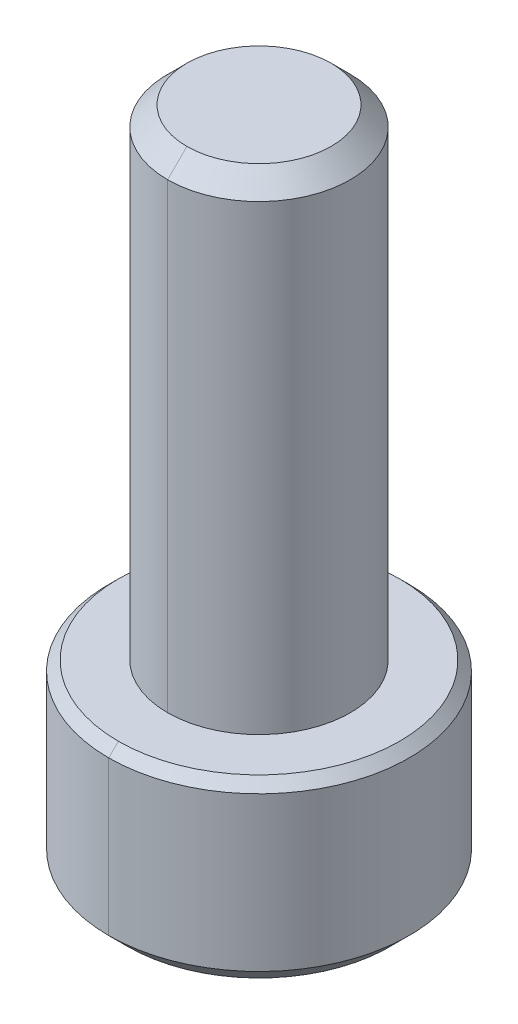
ISO-10303-21;
HEADER;
FILE_DESCRIPTION(('STEP AP214'),'2;1');
FILE_NAME('part.step','',(''),(''),'','','');
FILE_SCHEMA(('AUTOMOTIVE_DESIGN { 1 0 10303 214 1 1 1 1 }'));
ENDSEC;
DATA;
#1=APPLICATION_CONTEXT('core data for automotive mechanical design processes');
#2=APPLICATION_PROTOCOL_DEFINITION('international standard','automotive_design',2000,#1);
#3=PRODUCT_CONTEXT('',#1,'mechanical');
#4=PRODUCT('Part','Part','',(#3));
#5=PRODUCT_RELATED_PRODUCT_CATEGORY('part','',(#4));
#6=PRODUCT_DEFINITION_FORMATION('','',#4);
#7=PRODUCT_DEFINITION_CONTEXT('part definition',#1,'design');
#8=PRODUCT_DEFINITION('design','',#6,#7);
#9=PRODUCT_DEFINITION_SHAPE('','',#8);
#10=(LENGTH_UNIT() NAMED_UNIT(*) SI_UNIT(.MILLI.,.METRE.));
#11=(NAMED_UNIT(*) PLANE_ANGLE_UNIT() SI_UNIT($,.RADIAN.));
#12=(NAMED_UNIT(*) SI_UNIT($,.STERADIAN.) SOLID_ANGLE_UNIT());
#13=UNCERTAINTY_MEASURE_WITH_UNIT(LENGTH_MEASURE(1.E-05),#10,'distance_accuracy_value','');
#14=(GEOMETRIC_REPRESENTATION_CONTEXT(3) GLOBAL_UNCERTAINTY_ASSIGNED_CONTEXT((#13)) GLOBAL_UNIT_ASSIGNED_CONTEXT((#10,
#11,#12)) REPRESENTATION_CONTEXT('',''));
#15=CARTESIAN_POINT('',(0.,0.,0.));
#16=DIRECTION('',(0.,0.,1.));
#17=DIRECTION('',(1.,0.,0.));
#18=AXIS2_PLACEMENT_3D('',#15,#16,#17);
#19=CARTESIAN_POINT('',(0.,-0.254,0.));
#20=DIRECTION('',(0.,-1.,0.));
#21=DIRECTION('',(0.,0.,-1.));
#22=AXIS2_PLACEMENT_3D('',#19,#20,#21);
#23=CONICAL_SURFACE('',#22,3.96875,0.785398163397452);
#24=DIRECTION('',(0.,-0.707106781186545,0.70710678118655));
#25=VECTOR('',#24,1.);
#26=CARTESIAN_POINT('',(0.,-0.254,3.96875));
#27=LINE('',#26,#25);
#28=CARTESIAN_POINT('',(0.,0.,3.71475));
#29=VERTEX_POINT('',#28);
#30=CARTESIAN_POINT('',(0.,-0.254,3.96875));
#31=VERTEX_POINT('',#30);
#32=EDGE_CURVE('E246',#29,#31,#27,.T.);
#33=ORIENTED_EDGE('',*,*,#32,.F.);
#34=CARTESIAN_POINT('',(0.,0.,0.));
#35=DIRECTION('',(0.,1.,0.));
#36=DIRECTION('',(0.,0.,-1.));
#37=AXIS2_PLACEMENT_3D('',#34,#35,#36);
#38=CIRCLE('',#37,3.71475);
#39=CARTESIAN_POINT('',(0.,0.,-3.71475));
#40=VERTEX_POINT('',#39);
#41=EDGE_CURVE('E263',#40,#29,#38,.T.);
#42=ORIENTED_EDGE('',*,*,#41,.F.);
#43=DIRECTION('',(0.,-0.707106781186545,-0.70710678118655));
#44=VECTOR('',#43,1.);
#45=CARTESIAN_POINT('',(0.,-0.254,-3.96875));
#46=LINE('',#45,#44);
#47=CARTESIAN_POINT('',(0.,-0.254,-3.96875));
#48=VERTEX_POINT('',#47);
#49=EDGE_CURVE('E249',#40,#48,#46,.T.);
#50=ORIENTED_EDGE('',*,*,#49,.T.);
#51=CARTESIAN_POINT('',(0.,-0.254,0.));
#52=DIRECTION('',(0.,-1.,0.));
#53=DIRECTION('',(0.,0.,-1.));
#54=AXIS2_PLACEMENT_3D('',#51,#52,#53);
#55=CIRCLE('',#54,3.96875);
#56=EDGE_CURVE('E256',#31,#48,#55,.T.);
#57=ORIENTED_EDGE('',*,*,#56,.F.);
#58=EDGE_LOOP('',(#33,#42,#50,#57));
#59=FACE_BOUND('',#58,.T.);
#60=ADVANCED_FACE('F16',(#59),#23,.T.);
#61=CARTESIAN_POINT('',(0.,-4.826,0.));
#62=DIRECTION('',(0.,1.,0.));
#63=DIRECTION('',(0.,0.,1.));
#64=AXIS2_PLACEMENT_3D('',#61,#62,#63);
#65=CONICAL_SURFACE('',#64,3.46075,0.785398163397448);
#66=DIRECTION('',(0.,0.707106781186548,-0.707106781186548));
#67=VECTOR('',#66,1.);
#68=CARTESIAN_POINT('',(0.,-4.826,-3.46075));
#69=LINE('',#68,#67);
#70=CARTESIAN_POINT('',(0.,-4.826,-3.46075));
#71=VERTEX_POINT('',#70);
#72=CARTESIAN_POINT('',(0.,-4.318,-3.96875));
#73=VERTEX_POINT('',#72);
#74=EDGE_CURVE('E228',#71,#73,#69,.T.);
#75=ORIENTED_EDGE('',*,*,#74,.F.);
#76=CARTESIAN_POINT('',(0.,-4.826,0.));
#77=DIRECTION('',(0.,-1.,0.));
#78=DIRECTION('',(0.,0.,-1.));
#79=AXIS2_PLACEMENT_3D('',#76,#77,#78);
#80=CIRCLE('',#79,3.46075);
#81=CARTESIAN_POINT('',(0.,-4.826,3.46075));
#82=VERTEX_POINT('',#81);
#83=EDGE_CURVE('E259',#82,#71,#80,.T.);
#84=ORIENTED_EDGE('',*,*,#83,.F.);
#85=DIRECTION('',(0.,0.707106781186548,0.707106781186548));
#86=VECTOR('',#85,1.);
#87=CARTESIAN_POINT('',(0.,-4.826,3.46075));
#88=LINE('',#87,#86);
#89=CARTESIAN_POINT('',(0.,-4.318,3.96875));
#90=VERTEX_POINT('',#89);
#91=EDGE_CURVE('E222',#82,#90,#88,.T.);
#92=ORIENTED_EDGE('',*,*,#91,.T.);
#93=CARTESIAN_POINT('',(0.,-4.318,0.));
#94=DIRECTION('',(0.,1.,0.));
#95=DIRECTION('',(0.,0.,-1.));
#96=AXIS2_PLACEMENT_3D('',#93,#94,#95);
#97=CIRCLE('',#96,3.96875);
#98=EDGE_CURVE('E138',#73,#90,#97,.T.);
#99=ORIENTED_EDGE('',*,*,#98,.F.);
#100=EDGE_LOOP('',(#75,#84,#92,#99));
#101=FACE_BOUND('',#100,.T.);
#102=ADVANCED_FACE('F295',(#101),#65,.T.);
#103=CARTESIAN_POINT('',(1.984375,-1.8494248,-1.14567944042316));
#104=DIRECTION('',(1.,0.,0.));
#105=DIRECTION('',(0.,0.,-1.));
#106=AXIS2_PLACEMENT_3D('',#103,#104,#105);
#107=PLANE('',#106);
#108=DIRECTION('',(0.,-1.,0.));
#109=VECTOR('',#108,1.);
#110=CARTESIAN_POINT('',(1.984375,-1.8494248,-1.14567944042316));
#111=LINE('',#110,#109);
#112=CARTESIAN_POINT('',(1.984375,-1.8494248,-1.14567944042316));
#113=VERTEX_POINT('',#112);
#114=CARTESIAN_POINT('',(1.984375,-4.826,-1.14567944042316));
#115=VERTEX_POINT('',#114);
#116=EDGE_CURVE('E11',#113,#115,#111,.T.);
#117=ORIENTED_EDGE('',*,*,#116,.T.);
#118=CARTESIAN_POINT('',(1.984375,-4.826,-1.14567944042316));
#119=CARTESIAN_POINT('',(1.984375,-4.68036208510538,-0.854403610634551));
#120=CARTESIAN_POINT('',(1.984375,-4.60506326337506,-0.590680721420027));
#121=CARTESIAN_POINT('',(1.984375,-4.51924433500676,-0.29011272820971));
#122=CARTESIAN_POINT('',(1.984375,-4.51901637621626,-0.00101005810057195));
#123=CARTESIAN_POINT('',(1.984375,-4.51878865540112,0.287790806093884));
#124=CARTESIAN_POINT('',(1.984375,-4.60492537223951,0.590197211066081));
#125=CARTESIAN_POINT('',(1.984375,-4.67994195088672,0.853563342196651));
#126=CARTESIAN_POINT('',(1.984375,-4.826,1.14567944042317));
#127=B_SPLINE_CURVE_WITH_KNOTS('',2,(#118,#119,#120,#121,#122,#123,#124,#125,#126),
.UNSPECIFIED.,.F.,.F.,(3,2,2,2,3),(0.,0.25,0.5,0.75,1.),.UNSPECIFIED.);
#128=CARTESIAN_POINT('',(1.984375,-4.826,1.14567944042316));
#129=VERTEX_POINT('',#128);
#130=EDGE_CURVE('E216',#115,#129,#127,.T.);
#131=ORIENTED_EDGE('',*,*,#130,.T.);
#132=DIRECTION('',(0.,-1.,0.));
#133=VECTOR('',#132,1.);
#134=CARTESIAN_POINT('',(1.984375,-1.8494248,1.14567944042316));
#135=LINE('',#134,#133);
#136=CARTESIAN_POINT('',(1.984375,-1.8494248,1.14567944042316));
#137=VERTEX_POINT('',#136);
#138=EDGE_CURVE('E227',#137,#129,#135,.T.);
#139=ORIENTED_EDGE('',*,*,#138,.F.);
#140=DIRECTION('',(0.,0.,1.));
#141=VECTOR('',#140,1.);
#142=CARTESIAN_POINT('',(1.984375,-1.8494248,-1.14567944042316));
#143=LINE('',#142,#141);
#144=EDGE_CURVE('E211',#113,#137,#143,.T.);
#145=ORIENTED_EDGE('',*,*,#144,.F.);
#146=EDGE_LOOP('',(#117,#131,#139,#145));
#147=FACE_BOUND('',#146,.T.);
#148=ADVANCED_FACE('F284',(#147),#107,.F.);
#149=CARTESIAN_POINT('',(0.,-1.8494248,-2.29135888084633));
#150=DIRECTION('',(0.5,0.,-0.866025403784439));
#151=DIRECTION('',(0.,-1.,0.));
#152=AXIS2_PLACEMENT_3D('',#149,#150,#151);
#153=PLANE('',#152);
#154=DIRECTION('',(0.,-1.,0.));
#155=VECTOR('',#154,1.);
#156=CARTESIAN_POINT('',(0.,-1.8494248,-2.29135888084633));
#157=LINE('',#156,#155);
#158=CARTESIAN_POINT('',(0.,-1.8494248,-2.29135888084633));
#159=VERTEX_POINT('',#158);
#160=CARTESIAN_POINT('',(0.,-4.826,-2.29135888084633));
#161=VERTEX_POINT('',#160);
#162=EDGE_CURVE('E29',#159,#161,#157,.T.);
#163=ORIENTED_EDGE('',*,*,#162,.T.);
#164=CARTESIAN_POINT('',(0.,-4.826,-2.29135888084633));
#165=CARTESIAN_POINT('',(0.250705601837018,-4.68125505329205,-2.14661393413838));
#166=CARTESIAN_POINT('',(0.477795416201183,-4.60600373712399,-2.01550356868501));
#167=CARTESIAN_POINT('',(0.738188216368874,-4.51971672778291,-1.86516571541315));
#168=CARTESIAN_POINT('',(0.98853321615525,-4.51902060546134,-1.72062896239621));
#169=CARTESIAN_POINT('',(1.23842353131887,-4.51832574745947,-1.57635472166861));
#170=CARTESIAN_POINT('',(1.49993800055402,-4.60381766270318,-1.42536927245872));
#171=CARTESIAN_POINT('',(1.72956436293042,-4.67888501009477,-1.29279443032767));
#172=CARTESIAN_POINT('',(1.984375,-4.826,-1.14567944042316));
#173=B_SPLINE_CURVE_WITH_KNOTS('',2,(#164,#165,#166,#167,#168,#169,#170,#171,#172),
.UNSPECIFIED.,.F.,.F.,(3,2,2,2,3),(0.,0.25,0.5,0.75,1.),.UNSPECIFIED.);
#174=EDGE_CURVE('E487',#161,#115,#173,.T.);
#175=ORIENTED_EDGE('',*,*,#174,.T.);
#176=ORIENTED_EDGE('',*,*,#116,.F.);
#177=DIRECTION('',(0.866025403784439,0.,0.5));
#178=VECTOR('',#177,1.);
#179=CARTESIAN_POINT('',(0.,-1.8494248,-2.29135888084633));
#180=LINE('',#179,#178);
#181=EDGE_CURVE('E209',#159,#113,#180,.T.);
#182=ORIENTED_EDGE('',*,*,#181,.F.);
#183=EDGE_LOOP('',(#163,#175,#176,#182));
#184=FACE_BOUND('',#183,.T.);
#185=ADVANCED_FACE('F294',(#184),#153,.F.);
#186=CARTESIAN_POINT('',(-1.984375,-1.8494248,-1.14567944042316));
#187=DIRECTION('',(-0.5,0.,-0.866025403784439));
#188=DIRECTION('',(-0.866025403784439,0.,0.5));
#189=AXIS2_PLACEMENT_3D('',#186,#187,#188);
#190=PLANE('',#189);
#191=DIRECTION('',(0.,-1.,0.));
#192=VECTOR('',#191,1.);
#193=CARTESIAN_POINT('',(-1.984375,-1.8494248,-1.14567944042316));
#194=LINE('',#193,#192);
#195=CARTESIAN_POINT('',(-1.984375,-1.8494248,-1.14567944042316));
#196=VERTEX_POINT('',#195);
#197=CARTESIAN_POINT('',(-1.984375,-4.826,-1.14567944042316));
#198=VERTEX_POINT('',#197);
#199=EDGE_CURVE('E332',#196,#198,#194,.T.);
#200=ORIENTED_EDGE('',*,*,#199,.T.);
#201=CARTESIAN_POINT('',(-1.984375,-4.826,-1.14567944042316));
#202=CARTESIAN_POINT('',(-1.73366939816202,-4.6812550532915,-1.29042438713167));
#203=CARTESIAN_POINT('',(-1.50657958379882,-4.606003737124,-1.42153475258448));
#204=CARTESIAN_POINT('',(-1.24618678363029,-4.51971672778291,-1.57187260585682));
#205=CARTESIAN_POINT('',(-0.99584178384475,-4.51902060546134,-1.71640935887328));
#206=CARTESIAN_POINT('',(-0.745951468679565,-4.51832574745947,-1.86068359960178));
#207=CARTESIAN_POINT('',(-0.484436999445984,-4.60381766270318,-2.01166904881077));
#208=CARTESIAN_POINT('',(-0.254810637067759,-4.67888501009583,-2.14424389094287));
#209=CARTESIAN_POINT('',(0.,-4.826,-2.29135888084632));
#210=B_SPLINE_CURVE_WITH_KNOTS('',2,(#201,#202,#203,#204,#205,#206,#207,#208,#209),
.UNSPECIFIED.,.F.,.F.,(3,2,2,2,3),(0.,0.25,0.5,0.75,1.),.UNSPECIFIED.);
#211=EDGE_CURVE('E483',#198,#161,#210,.T.);
#212=ORIENTED_EDGE('',*,*,#211,.T.);
#213=ORIENTED_EDGE('',*,*,#162,.F.);
#214=DIRECTION('',(0.866025403784439,0.,-0.5));
#215=VECTOR('',#214,1.);
#216=CARTESIAN_POINT('',(-1.984375,-1.8494248,-1.14567944042316));
#217=LINE('',#216,#215);
#218=EDGE_CURVE('E206',#196,#159,#217,.T.);
#219=ORIENTED_EDGE('',*,*,#218,.F.);
#220=EDGE_LOOP('',(#200,#212,#213,#219));
#221=FACE_BOUND('',#220,.T.);
#222=ADVANCED_FACE('F373',(#221),#190,.F.);
#223=CARTESIAN_POINT('',(-1.984375,-1.8494248,1.14567944042316));
#224=DIRECTION('',(-1.,0.,0.));
#225=DIRECTION('',(0.,0.,1.));
#226=AXIS2_PLACEMENT_3D('',#223,#224,#225);
#227=PLANE('',#226);
#228=DIRECTION('',(0.,-1.,0.));
#229=VECTOR('',#228,1.);
#230=CARTESIAN_POINT('',(-1.984375,-1.8494248,1.14567944042316));
#231=LINE('',#230,#229);
#232=CARTESIAN_POINT('',(-1.984375,-1.8494248,1.14567944042316));
#233=VERTEX_POINT('',#232);
#234=CARTESIAN_POINT('',(-1.984375,-4.826,1.14567944042316));
#235=VERTEX_POINT('',#234);
#236=EDGE_CURVE('E341',#233,#235,#231,.T.);
#237=ORIENTED_EDGE('',*,*,#236,.T.);
#238=CARTESIAN_POINT('',(-1.984375,-4.826,1.14567944042316));
#239=CARTESIAN_POINT('',(-1.984375,-4.68036208510536,0.854403610634491));
#240=CARTESIAN_POINT('',(-1.984375,-4.60506326337506,0.590680721420027));
#241=CARTESIAN_POINT('',(-1.984375,-4.51924433500676,0.290112728209678));
#242=CARTESIAN_POINT('',(-1.984375,-4.51901637621626,0.00101005810056978));
#243=CARTESIAN_POINT('',(-1.984375,-4.51878865540112,-0.287790806093884));
#244=CARTESIAN_POINT('',(-1.984375,-4.60492537223951,-0.590197211066078));
#245=CARTESIAN_POINT('',(-1.984375,-4.67994195088672,-0.853563342196648));
#246=CARTESIAN_POINT('',(-1.984375,-4.826,-1.14567944042316));
#247=B_SPLINE_CURVE_WITH_KNOTS('',2,(#238,#239,#240,#241,#242,#243,#244,#245,#246),
.UNSPECIFIED.,.F.,.F.,(3,2,2,2,3),(0.,0.25,0.5,0.75,1.),.UNSPECIFIED.);
#248=EDGE_CURVE('E356',#235,#198,#247,.T.);
#249=ORIENTED_EDGE('',*,*,#248,.T.);
#250=ORIENTED_EDGE('',*,*,#199,.F.);
#251=DIRECTION('',(0.,0.,-1.));
#252=VECTOR('',#251,1.);
#253=CARTESIAN_POINT('',(-1.984375,-1.8494248,1.14567944042316));
#254=LINE('',#253,#252);
#255=EDGE_CURVE('E210',#233,#196,#254,.T.);
#256=ORIENTED_EDGE('',*,*,#255,.F.);
#257=EDGE_LOOP('',(#237,#249,#250,#256));
#258=FACE_BOUND('',#257,.T.);
#259=ADVANCED_FACE('F362',(#258),#227,.F.);
#260=CARTESIAN_POINT('',(0.,-1.8494248,2.29135888084633));
#261=DIRECTION('',(-0.5,0.,0.866025403784439));
#262=DIRECTION('',(0.,1.,0.));
#263=AXIS2_PLACEMENT_3D('',#260,#261,#262);
#264=PLANE('',#263);
#265=DIRECTION('',(0.,-1.,0.));
#266=VECTOR('',#265,1.);
#267=CARTESIAN_POINT('',(0.,-1.8494248,2.29135888084633));
#268=LINE('',#267,#266);
#269=CARTESIAN_POINT('',(0.,-1.8494248,2.29135888084633));
#270=VERTEX_POINT('',#269);
#271=CARTESIAN_POINT('',(0.,-4.826,2.29135888084633));
#272=VERTEX_POINT('',#271);
#273=EDGE_CURVE('E388',#270,#272,#268,.T.);
#274=ORIENTED_EDGE('',*,*,#273,.T.);
#275=CARTESIAN_POINT('',(0.,-4.826,2.29135888084633));
#276=CARTESIAN_POINT('',(-0.250705601836271,-4.68125505329248,2.14661393413881));
#277=CARTESIAN_POINT('',(-0.477795416201183,-4.606003737124,2.01550356868501));
#278=CARTESIAN_POINT('',(-0.738188216366829,-4.51971672778338,1.86516571541433));
#279=CARTESIAN_POINT('',(-0.988533216155249,-4.51902060546134,1.72062896239621));
#280=CARTESIAN_POINT('',(-1.23842353131898,-4.518325747459,1.57635472166855));
#281=CARTESIAN_POINT('',(-1.49993800055402,-4.60381766270318,1.42536927245872));
#282=CARTESIAN_POINT('',(-1.72956436293218,-4.67888501009579,1.29279443032665));
#283=CARTESIAN_POINT('',(-1.984375,-4.826,1.14567944042316));
#284=B_SPLINE_CURVE_WITH_KNOTS('',2,(#275,#276,#277,#278,#279,#280,#281,#282,#283),
.UNSPECIFIED.,.F.,.F.,(3,2,2,2,3),(0.,0.25,0.5,0.75,1.),.UNSPECIFIED.);
#285=EDGE_CURVE('E463',#272,#235,#284,.T.);
#286=ORIENTED_EDGE('',*,*,#285,.T.);
#287=ORIENTED_EDGE('',*,*,#236,.F.);
#288=DIRECTION('',(-0.866025403784439,0.,-0.5));
#289=VECTOR('',#288,1.);
#290=CARTESIAN_POINT('',(0.,-1.8494248,2.29135888084633));
#291=LINE('',#290,#289);
#292=EDGE_CURVE('E856',#270,#233,#291,.T.);
#293=ORIENTED_EDGE('',*,*,#292,.F.);
#294=EDGE_LOOP('',(#274,#286,#287,#293));
#295=FACE_BOUND('',#294,.T.);
#296=ADVANCED_FACE('F372',(#295),#264,.F.);
#297=CARTESIAN_POINT('',(1.984375,-1.8494248,1.14567944042316));
#298=DIRECTION('',(0.5,0.,0.866025403784438));
#299=DIRECTION('',(0.,-1.,0.));
#300=AXIS2_PLACEMENT_3D('',#297,#298,#299);
#301=PLANE('',#300);
#302=ORIENTED_EDGE('',*,*,#138,.T.);
#303=CARTESIAN_POINT('',(1.984375,-4.826,1.14567944042316));
#304=CARTESIAN_POINT('',(1.73366939816205,-4.68125505329151,1.29042438713165));
#305=CARTESIAN_POINT('',(1.50657958379882,-4.606003737124,1.42153475258448));
#306=CARTESIAN_POINT('',(1.24618678363103,-4.51971672778314,1.5718726058564));
#307=CARTESIAN_POINT('',(0.995841783844754,-4.51902060546134,1.71640935887328));
#308=CARTESIAN_POINT('',(0.745951468680323,-4.51832574745923,1.86068359960134));
#309=CARTESIAN_POINT('',(0.484436999445986,-4.60381766270318,2.01166904881077));
#310=CARTESIAN_POINT('',(0.254810637067813,-4.67888501009579,2.14424389094284));
#311=CARTESIAN_POINT('',(0.,-4.826,2.29135888084632));
#312=B_SPLINE_CURVE_WITH_KNOTS('',2,(#303,#304,#305,#306,#307,#308,#309,#310,#311),
.UNSPECIFIED.,.F.,.F.,(3,2,2,2,3),(0.,0.25,0.5,0.75,1.),.UNSPECIFIED.);
#313=EDGE_CURVE('E265',#129,#272,#312,.T.);
#314=ORIENTED_EDGE('',*,*,#313,.T.);
#315=ORIENTED_EDGE('',*,*,#273,.F.);
#316=DIRECTION('',(-0.866025403784439,0.,0.5));
#317=VECTOR('',#316,1.);
#318=CARTESIAN_POINT('',(1.984375,-1.8494248,1.14567944042316));
#319=LINE('',#318,#317);
#320=EDGE_CURVE('E215',#137,#270,#319,.T.);
#321=ORIENTED_EDGE('',*,*,#320,.F.);
#322=EDGE_LOOP('',(#302,#314,#315,#321));
#323=FACE_BOUND('',#322,.T.);
#324=ADVANCED_FACE('F302',(#323),#301,.F.);
#325=CARTESIAN_POINT('',(0.,-1.8494248,0.));
#326=DIRECTION('',(0.,-1.,0.));
#327=DIRECTION('',(0.,0.,-1.));
#328=AXIS2_PLACEMENT_3D('',#325,#326,#327);
#329=PLANE('',#328);
#330=ORIENTED_EDGE('',*,*,#144,.T.);
#331=ORIENTED_EDGE('',*,*,#320,.T.);
#332=ORIENTED_EDGE('',*,*,#292,.T.);
#333=ORIENTED_EDGE('',*,*,#255,.T.);
#334=ORIENTED_EDGE('',*,*,#218,.T.);
#335=ORIENTED_EDGE('',*,*,#181,.T.);
#336=EDGE_LOOP('',(#330,#331,#332,#333,#334,#335));
#337=FACE_BOUND('',#336,.T.);
#338=ADVANCED_FACE('F298',(#337),#329,.T.);
#339=CARTESIAN_POINT('',(0.,-4.826,0.));
#340=DIRECTION('',(0.,-1.,0.));
#341=DIRECTION('',(0.,0.,-1.));
#342=AXIS2_PLACEMENT_3D('',#339,#340,#341);
#343=CONICAL_SURFACE('',#342,2.29135888084632,0.78539816339745);
#344=CARTESIAN_POINT('',(0.,-4.826,0.));
#345=DIRECTION('',(0.,-1.,0.));
#346=DIRECTION('',(0.,0.,-1.));
#347=AXIS2_PLACEMENT_3D('',#344,#345,#346);
#348=CIRCLE('',#347,2.29135888084632);
#349=EDGE_CURVE('E266',#115,#129,#348,.T.);
#350=ORIENTED_EDGE('',*,*,#349,.T.);
#351=ORIENTED_EDGE('',*,*,#130,.F.);
#352=EDGE_LOOP('',(#350,#351));
#353=FACE_BOUND('',#352,.T.);
#354=ADVANCED_FACE('F301',(#353),#343,.F.);
#355=CARTESIAN_POINT('',(0.,-4.826,0.));
#356=DIRECTION('',(0.,-1.,0.));
#357=DIRECTION('',(0.,0.,-1.));
#358=AXIS2_PLACEMENT_3D('',#355,#356,#357);
#359=CONICAL_SURFACE('',#358,2.29135888084632,0.78539816339745);
#360=CARTESIAN_POINT('',(0.,-4.826,0.));
#361=DIRECTION('',(0.,-1.,0.));
#362=DIRECTION('',(0.,0.,-1.));
#363=AXIS2_PLACEMENT_3D('',#360,#361,#362);
#364=CIRCLE('',#363,2.29135888084632);
#365=EDGE_CURVE('E262',#161,#115,#364,.T.);
#366=ORIENTED_EDGE('',*,*,#365,.T.);
#367=ORIENTED_EDGE('',*,*,#174,.F.);
#368=EDGE_LOOP('',(#366,#367));
#369=FACE_BOUND('',#368,.T.);
#370=ADVANCED_FACE('F321',(#369),#359,.F.);
#371=CARTESIAN_POINT('',(0.,-4.826,0.));
#372=DIRECTION('',(0.,-1.,0.));
#373=DIRECTION('',(0.,0.,-1.));
#374=AXIS2_PLACEMENT_3D('',#371,#372,#373);
#375=CONICAL_SURFACE('',#374,2.29135888084632,0.78539816339745);
#376=CARTESIAN_POINT('',(0.,-4.826,0.));
#377=DIRECTION('',(0.,-1.,0.));
#378=DIRECTION('',(0.,0.,-1.));
#379=AXIS2_PLACEMENT_3D('',#376,#377,#378);
#380=CIRCLE('',#379,2.29135888084632);
#381=EDGE_CURVE('E349',#198,#161,#380,.T.);
#382=ORIENTED_EDGE('',*,*,#381,.T.);
#383=ORIENTED_EDGE('',*,*,#211,.F.);
#384=EDGE_LOOP('',(#382,#383));
#385=FACE_BOUND('',#384,.T.);
#386=ADVANCED_FACE('F316',(#385),#375,.F.);
#387=CARTESIAN_POINT('',(0.,-4.826,0.));
#388=DIRECTION('',(0.,-1.,0.));
#389=DIRECTION('',(0.,0.,-1.));
#390=AXIS2_PLACEMENT_3D('',#387,#388,#389);
#391=CONICAL_SURFACE('',#390,2.29135888084632,0.78539816339745);
#392=CARTESIAN_POINT('',(0.,-4.826,0.));
#393=DIRECTION('',(0.,-1.,0.));
#394=DIRECTION('',(0.,0.,-1.));
#395=AXIS2_PLACEMENT_3D('',#392,#393,#394);
#396=CIRCLE('',#395,2.29135888084632);
#397=EDGE_CURVE('E344',#235,#198,#396,.T.);
#398=ORIENTED_EDGE('',*,*,#397,.T.);
#399=ORIENTED_EDGE('',*,*,#248,.F.);
#400=EDGE_LOOP('',(#398,#399));
#401=FACE_BOUND('',#400,.T.);
#402=ADVANCED_FACE('F320',(#401),#391,.F.);
#403=CARTESIAN_POINT('',(0.,-4.826,0.));
#404=DIRECTION('',(0.,-1.,0.));
#405=DIRECTION('',(0.,0.,-1.));
#406=AXIS2_PLACEMENT_3D('',#403,#404,#405);
#407=CONICAL_SURFACE('',#406,2.29135888084632,0.78539816339745);
#408=CARTESIAN_POINT('',(0.,-4.826,0.));
#409=DIRECTION('',(0.,-1.,0.));
#410=DIRECTION('',(0.,0.,-1.));
#411=AXIS2_PLACEMENT_3D('',#408,#409,#410);
#412=CIRCLE('',#411,2.29135888084632);
#413=EDGE_CURVE('E348',#272,#235,#412,.T.);
#414=ORIENTED_EDGE('',*,*,#413,.T.);
#415=ORIENTED_EDGE('',*,*,#285,.F.);
#416=EDGE_LOOP('',(#414,#415));
#417=FACE_BOUND('',#416,.T.);
#418=ADVANCED_FACE('F311',(#417),#407,.F.);
#419=CARTESIAN_POINT('',(0.,-4.826,0.));
#420=DIRECTION('',(0.,-1.,0.));
#421=DIRECTION('',(0.,0.,-1.));
#422=AXIS2_PLACEMENT_3D('',#419,#420,#421);
#423=CONICAL_SURFACE('',#422,2.29135888084632,0.78539816339745);
#424=CARTESIAN_POINT('',(0.,-4.826,0.));
#425=DIRECTION('',(0.,-1.,0.));
#426=DIRECTION('',(0.,0.,-1.));
#427=AXIS2_PLACEMENT_3D('',#424,#425,#426);
#428=CIRCLE('',#427,2.29135888084632);
#429=EDGE_CURVE('E457',#129,#272,#428,.T.);
#430=ORIENTED_EDGE('',*,*,#429,.T.);
#431=ORIENTED_EDGE('',*,*,#313,.F.);
#432=EDGE_LOOP('',(#430,#431));
#433=FACE_BOUND('',#432,.T.);
#434=ADVANCED_FACE('F307',(#433),#423,.F.);
#435=CARTESIAN_POINT('',(0.,0.,0.));
#436=DIRECTION('',(0.,-1.,0.));
#437=DIRECTION('',(0.,0.,-1.));
#438=AXIS2_PLACEMENT_3D('',#435,#436,#437);
#439=PLANE('',#438);
#440=CARTESIAN_POINT('',(0.,0.,0.));
#441=DIRECTION('',(0.,1.,0.));
#442=DIRECTION('',(0.,0.,1.));
#443=AXIS2_PLACEMENT_3D('',#440,#441,#442);
#444=CIRCLE('',#443,2.413);
#445=CARTESIAN_POINT('',(0.,0.,-2.413));
#446=VERTEX_POINT('',#445);
#447=CARTESIAN_POINT('',(0.,0.,2.413));
#448=VERTEX_POINT('',#447);
#449=EDGE_CURVE('E123',#446,#448,#444,.T.);
#450=ORIENTED_EDGE('',*,*,#449,.F.);
#451=CARTESIAN_POINT('',(0.,0.,0.));
#452=DIRECTION('',(0.,1.,0.));
#453=DIRECTION('',(0.,0.,1.));
#454=AXIS2_PLACEMENT_3D('',#451,#452,#453);
#455=CIRCLE('',#454,2.413);
#456=EDGE_CURVE('E183',#448,#446,#455,.T.);
#457=ORIENTED_EDGE('',*,*,#456,.F.);
#458=EDGE_LOOP('',(#450,#457));
#459=FACE_BOUND('',#458,.T.);
#460=ORIENTED_EDGE('',*,*,#41,.T.);
#461=CARTESIAN_POINT('',(0.,0.,0.));
#462=DIRECTION('',(0.,1.,0.));
#463=DIRECTION('',(0.,0.,-1.));
#464=AXIS2_PLACEMENT_3D('',#461,#462,#463);
#465=CIRCLE('',#464,3.71475);
#466=EDGE_CURVE('E242',#29,#40,#465,.T.);
#467=ORIENTED_EDGE('',*,*,#466,.T.);
#468=EDGE_LOOP('',(#460,#467));
#469=FACE_BOUND('',#468,.T.);
#470=ADVANCED_FACE('F18',(#459,#469),#439,.F.);
#471=CARTESIAN_POINT('',(0.,-4.826,0.));
#472=DIRECTION('',(0.,-1.,0.));
#473=DIRECTION('',(0.,0.,-1.));
#474=AXIS2_PLACEMENT_3D('',#471,#472,#473);
#475=PLANE('',#474);
#476=ORIENTED_EDGE('',*,*,#365,.F.);
#477=ORIENTED_EDGE('',*,*,#381,.F.);
#478=ORIENTED_EDGE('',*,*,#397,.F.);
#479=ORIENTED_EDGE('',*,*,#413,.F.);
#480=ORIENTED_EDGE('',*,*,#429,.F.);
#481=ORIENTED_EDGE('',*,*,#349,.F.);
#482=EDGE_LOOP('',(#476,#477,#478,#479,#480,#481));
#483=FACE_BOUND('',#482,.T.);
#484=ORIENTED_EDGE('',*,*,#83,.T.);
#485=CARTESIAN_POINT('',(0.,-4.826,0.));
#486=DIRECTION('',(0.,-1.,0.));
#487=DIRECTION('',(0.,0.,-1.));
#488=AXIS2_PLACEMENT_3D('',#485,#486,#487);
#489=CIRCLE('',#488,3.46075);
#490=EDGE_CURVE('E233',#71,#82,#489,.T.);
#491=ORIENTED_EDGE('',*,*,#490,.T.);
#492=EDGE_LOOP('',(#484,#491));
#493=FACE_BOUND('',#492,.T.);
#494=ADVANCED_FACE('F379',(#483,#493),#475,.T.);
#495=CARTESIAN_POINT('',(0.,-4.826,0.));
#496=DIRECTION('',(0.,1.,0.));
#497=DIRECTION('',(0.,0.,1.));
#498=AXIS2_PLACEMENT_3D('',#495,#496,#497);
#499=CYLINDRICAL_SURFACE('',#498,3.96875);
#500=DIRECTION('',(0.,1.,0.));
#501=VECTOR('',#500,1.);
#502=CARTESIAN_POINT('',(0.,-4.826,-3.96875));
#503=LINE('',#502,#501);
#504=EDGE_CURVE('E219',#73,#48,#503,.T.);
#505=ORIENTED_EDGE('',*,*,#504,.F.);
#506=ORIENTED_EDGE('',*,*,#98,.T.);
#507=DIRECTION('',(0.,1.,0.));
#508=VECTOR('',#507,1.);
#509=CARTESIAN_POINT('',(0.,-4.826,3.96875));
#510=LINE('',#509,#508);
#511=EDGE_CURVE('E200',#90,#31,#510,.T.);
#512=ORIENTED_EDGE('',*,*,#511,.T.);
#513=ORIENTED_EDGE('',*,*,#56,.T.);
#514=EDGE_LOOP('',(#505,#506,#512,#513));
#515=FACE_BOUND('',#514,.T.);
#516=ADVANCED_FACE('F306',(#515),#499,.T.);
#517=CARTESIAN_POINT('',(0.,12.7,0.));
#518=DIRECTION('',(0.,-1.,0.));
#519=DIRECTION('',(0.,0.,-1.));
#520=AXIS2_PLACEMENT_3D('',#517,#518,#519);
#521=CONICAL_SURFACE('',#520,1.905,0.785398163397446);
#522=DIRECTION('',(0.,-0.707106781186549,0.707106781186546));
#523=VECTOR('',#522,1.);
#524=CARTESIAN_POINT('',(0.,12.7,1.905));
#525=LINE('',#524,#523);
#526=CARTESIAN_POINT('',(0.,12.7,1.905));
#527=VERTEX_POINT('',#526);
#528=CARTESIAN_POINT('',(0.,12.192,2.413));
#529=VERTEX_POINT('',#528);
#530=EDGE_CURVE('E168',#527,#529,#525,.T.);
#531=ORIENTED_EDGE('',*,*,#530,.F.);
#532=CARTESIAN_POINT('',(0.,12.7,0.));
#533=DIRECTION('',(0.,1.,0.));
#534=DIRECTION('',(0.,0.,1.));
#535=AXIS2_PLACEMENT_3D('',#532,#533,#534);
#536=CIRCLE('',#535,1.905);
#537=CARTESIAN_POINT('',(0.,12.7,-1.905));
#538=VERTEX_POINT('',#537);
#539=EDGE_CURVE('E236',#538,#527,#536,.T.);
#540=ORIENTED_EDGE('',*,*,#539,.F.);
#541=DIRECTION('',(0.,-0.707106781186549,-0.707106781186546));
#542=VECTOR('',#541,1.);
#543=CARTESIAN_POINT('',(0.,12.7,-1.905));
#544=LINE('',#543,#542);
#545=CARTESIAN_POINT('',(0.,12.192,-2.413));
#546=VERTEX_POINT('',#545);
#547=EDGE_CURVE('E171',#538,#546,#544,.T.);
#548=ORIENTED_EDGE('',*,*,#547,.T.);
#549=CARTESIAN_POINT('',(0.,12.192,0.));
#550=DIRECTION('',(0.,-1.,0.));
#551=DIRECTION('',(0.,0.,1.));
#552=AXIS2_PLACEMENT_3D('',#549,#550,#551);
#553=CIRCLE('',#552,2.413);
#554=EDGE_CURVE('E159',#529,#546,#553,.T.);
#555=ORIENTED_EDGE('',*,*,#554,.F.);
#556=EDGE_LOOP('',(#531,#540,#548,#555));
#557=FACE_BOUND('',#556,.T.);
#558=ADVANCED_FACE('F166',(#557),#521,.T.);
#559=CARTESIAN_POINT('',(0.,12.7,0.));
#560=DIRECTION('',(0.,1.,0.));
#561=DIRECTION('',(1.,0.,0.));
#562=AXIS2_PLACEMENT_3D('',#559,#560,#561);
#563=PLANE('',#562);
#564=ORIENTED_EDGE('',*,*,#539,.T.);
#565=CARTESIAN_POINT('',(0.,12.7,0.));
#566=DIRECTION('',(0.,1.,0.));
#567=DIRECTION('',(0.,0.,1.));
#568=AXIS2_PLACEMENT_3D('',#565,#566,#567);
#569=CIRCLE('',#568,1.905);
#570=EDGE_CURVE('E192',#527,#538,#569,.T.);
#571=ORIENTED_EDGE('',*,*,#570,.T.);
#572=EDGE_LOOP('',(#564,#571));
#573=FACE_BOUND('',#572,.T.);
#574=ADVANCED_FACE('F305',(#573),#563,.T.);
#575=CARTESIAN_POINT('',(0.,12.7,0.));
#576=DIRECTION('',(0.,-1.,0.));
#577=DIRECTION('',(0.,0.,-1.));
#578=AXIS2_PLACEMENT_3D('',#575,#576,#577);
#579=CYLINDRICAL_SURFACE('',#578,2.413);
#580=DIRECTION('',(0.,-1.,0.));
#581=VECTOR('',#580,1.);
#582=CARTESIAN_POINT('',(0.,12.7,2.413));
#583=LINE('',#582,#581);
#584=EDGE_CURVE('E177',#529,#448,#583,.T.);
#585=ORIENTED_EDGE('',*,*,#584,.F.);
#586=ORIENTED_EDGE('',*,*,#554,.T.);
#587=DIRECTION('',(0.,-1.,0.));
#588=VECTOR('',#587,1.);
#589=CARTESIAN_POINT('',(0.,12.7,-2.413));
#590=LINE('',#589,#588);
#591=EDGE_CURVE('E174',#546,#446,#590,.T.);
#592=ORIENTED_EDGE('',*,*,#591,.T.);
#593=ORIENTED_EDGE('',*,*,#449,.T.);
#594=EDGE_LOOP('',(#585,#586,#592,#593));
#595=FACE_BOUND('',#594,.T.);
#596=ADVANCED_FACE('F179',(#595),#579,.T.);
#597=CARTESIAN_POINT('',(0.,12.7,0.));
#598=DIRECTION('',(0.,-1.,0.));
#599=DIRECTION('',(0.,0.,-1.));
#600=AXIS2_PLACEMENT_3D('',#597,#598,#599);
#601=CYLINDRICAL_SURFACE('',#600,2.413);
#602=CARTESIAN_POINT('',(0.,12.192,0.));
#603=DIRECTION('',(0.,-1.,0.));
#604=DIRECTION('',(0.,0.,1.));
#605=AXIS2_PLACEMENT_3D('',#602,#603,#604);
#606=CIRCLE('',#605,2.413);
#607=EDGE_CURVE('E185',#546,#529,#606,.T.);
#608=ORIENTED_EDGE('',*,*,#607,.T.);
#609=ORIENTED_EDGE('',*,*,#584,.T.);
#610=ORIENTED_EDGE('',*,*,#456,.T.);
#611=ORIENTED_EDGE('',*,*,#591,.F.);
#612=EDGE_LOOP('',(#608,#609,#610,#611));
#613=FACE_BOUND('',#612,.T.);
#614=ADVANCED_FACE('F186',(#613),#601,.T.);
#615=CARTESIAN_POINT('',(0.,12.7,0.));
#616=DIRECTION('',(0.,-1.,0.));
#617=DIRECTION('',(0.,0.,-1.));
#618=AXIS2_PLACEMENT_3D('',#615,#616,#617);
#619=CONICAL_SURFACE('',#618,1.905,0.785398163397446);
#620=ORIENTED_EDGE('',*,*,#570,.F.);
#621=ORIENTED_EDGE('',*,*,#530,.T.);
#622=ORIENTED_EDGE('',*,*,#607,.F.);
#623=ORIENTED_EDGE('',*,*,#547,.F.);
#624=EDGE_LOOP('',(#620,#621,#622,#623));
#625=FACE_BOUND('',#624,.T.);
#626=ADVANCED_FACE('F190',(#625),#619,.T.);
#627=CARTESIAN_POINT('',(0.,-4.826,0.));
#628=DIRECTION('',(0.,1.,0.));
#629=DIRECTION('',(0.,0.,1.));
#630=AXIS2_PLACEMENT_3D('',#627,#628,#629);
#631=CYLINDRICAL_SURFACE('',#630,3.96875);
#632=CARTESIAN_POINT('',(0.,-4.318,0.));
#633=DIRECTION('',(0.,1.,0.));
#634=DIRECTION('',(0.,0.,-1.));
#635=AXIS2_PLACEMENT_3D('',#632,#633,#634);
#636=CIRCLE('',#635,3.96875);
#637=EDGE_CURVE('E232',#90,#73,#636,.T.);
#638=ORIENTED_EDGE('',*,*,#637,.T.);
#639=ORIENTED_EDGE('',*,*,#504,.T.);
#640=CARTESIAN_POINT('',(0.,-0.254,0.));
#641=DIRECTION('',(0.,-1.,0.));
#642=DIRECTION('',(0.,0.,-1.));
#643=AXIS2_PLACEMENT_3D('',#640,#641,#642);
#644=CIRCLE('',#643,3.96875);
#645=EDGE_CURVE('E204',#48,#31,#644,.T.);
#646=ORIENTED_EDGE('',*,*,#645,.T.);
#647=ORIENTED_EDGE('',*,*,#511,.F.);
#648=EDGE_LOOP('',(#638,#639,#646,#647));
#649=FACE_BOUND('',#648,.T.);
#650=ADVANCED_FACE('F296',(#649),#631,.T.);
#651=CARTESIAN_POINT('',(0.,-4.826,0.));
#652=DIRECTION('',(0.,1.,0.));
#653=DIRECTION('',(0.,0.,1.));
#654=AXIS2_PLACEMENT_3D('',#651,#652,#653);
#655=CONICAL_SURFACE('',#654,3.46075,0.785398163397448);
#656=ORIENTED_EDGE('',*,*,#490,.F.);
#657=ORIENTED_EDGE('',*,*,#74,.T.);
#658=ORIENTED_EDGE('',*,*,#637,.F.);
#659=ORIENTED_EDGE('',*,*,#91,.F.);
#660=EDGE_LOOP('',(#656,#657,#658,#659));
#661=FACE_BOUND('',#660,.T.);
#662=ADVANCED_FACE('F417',(#661),#655,.T.);
#663=CARTESIAN_POINT('',(0.,-0.254,0.));
#664=DIRECTION('',(0.,-1.,0.));
#665=DIRECTION('',(0.,0.,-1.));
#666=AXIS2_PLACEMENT_3D('',#663,#664,#665);
#667=CONICAL_SURFACE('',#666,3.96875,0.785398163397452);
#668=ORIENTED_EDGE('',*,*,#466,.F.);
#669=ORIENTED_EDGE('',*,*,#32,.T.);
#670=ORIENTED_EDGE('',*,*,#645,.F.);
#671=ORIENTED_EDGE('',*,*,#49,.F.);
#672=EDGE_LOOP('',(#668,#669,#670,#671));
#673=FACE_BOUND('',#672,.T.);
#674=ADVANCED_FACE('F419',(#673),#667,.T.);
#675=CLOSED_SHELL('',(#60,#102,#148,#185,#222,#259,#296,#324,#338,#354,#370,#386,#402,#418,#434,
#470,#494,#516,#558,#574,#596,#614,#626,#650,#662,#674));
#676=MANIFOLD_SOLID_BREP('B1',#675);
#677=ADVANCED_BREP_SHAPE_REPRESENTATION('',(#18,#676),#14);
#678=SHAPE_DEFINITION_REPRESENTATION(#9,#677);
ENDSEC;
END-ISO-10303-21;
